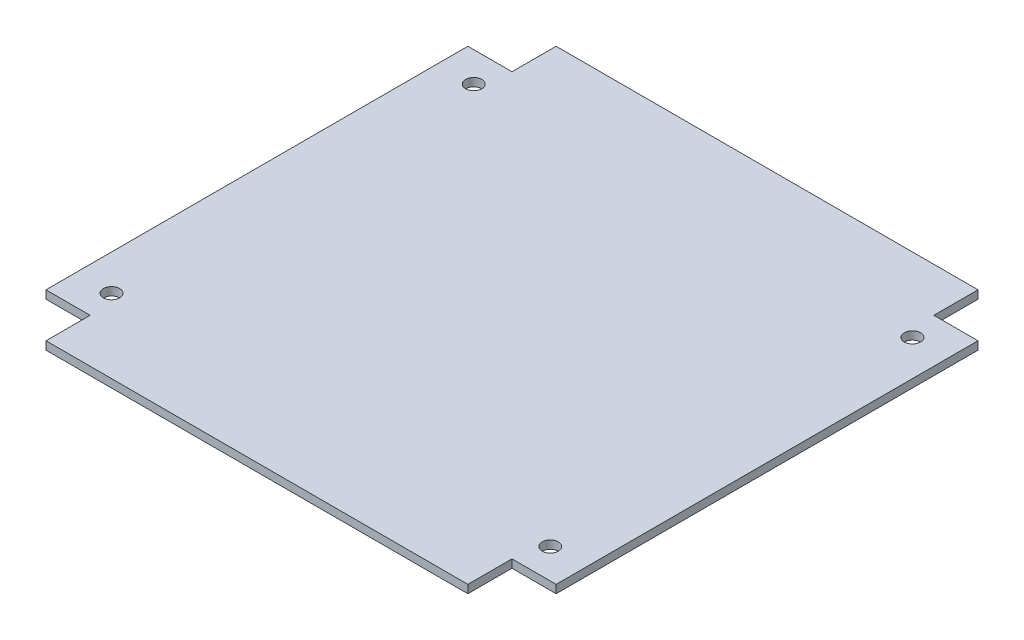
ISO-10303-21;
HEADER;
FILE_DESCRIPTION(('STEP AP214'),'2;1');
FILE_NAME('part.step','',(''),(''),'','','');
FILE_SCHEMA(('AUTOMOTIVE_DESIGN { 1 0 10303 214 1 1 1 1 }'));
ENDSEC;
DATA;
#1=APPLICATION_CONTEXT('core data for automotive mechanical design processes');
#2=APPLICATION_PROTOCOL_DEFINITION('international standard','automotive_design',2000,#1);
#3=PRODUCT_CONTEXT('',#1,'mechanical');
#4=PRODUCT('Part','Part','',(#3));
#5=PRODUCT_RELATED_PRODUCT_CATEGORY('part','',(#4));
#6=PRODUCT_DEFINITION_FORMATION('','',#4);
#7=PRODUCT_DEFINITION_CONTEXT('part definition',#1,'design');
#8=PRODUCT_DEFINITION('design','',#6,#7);
#9=PRODUCT_DEFINITION_SHAPE('','',#8);
#10=(LENGTH_UNIT() NAMED_UNIT(*) SI_UNIT(.MILLI.,.METRE.));
#11=(NAMED_UNIT(*) PLANE_ANGLE_UNIT() SI_UNIT($,.RADIAN.));
#12=(NAMED_UNIT(*) SI_UNIT($,.STERADIAN.) SOLID_ANGLE_UNIT());
#13=UNCERTAINTY_MEASURE_WITH_UNIT(LENGTH_MEASURE(1.E-05),#10,'distance_accuracy_value','');
#14=(GEOMETRIC_REPRESENTATION_CONTEXT(3) GLOBAL_UNCERTAINTY_ASSIGNED_CONTEXT((#13)) GLOBAL_UNIT_ASSIGNED_CONTEXT((#10,
#11,#12)) REPRESENTATION_CONTEXT('',''));
#15=CARTESIAN_POINT('',(0.,0.,0.));
#16=DIRECTION('',(0.,0.,1.));
#17=DIRECTION('',(1.,0.,0.));
#18=AXIS2_PLACEMENT_3D('',#15,#16,#17);
#19=CARTESIAN_POINT('',(41.350000000024,6.5,0.));
#20=DIRECTION('',(-1.,0.,0.));
#21=DIRECTION('',(0.,0.,1.));
#22=AXIS2_PLACEMENT_3D('',#19,#20,#21);
#23=PLANE('',#22);
#24=DIRECTION('',(0.,0.,1.));
#25=VECTOR('',#24,1.);
#26=CARTESIAN_POINT('',(41.350000000024,8.1,0.));
#27=LINE('',#26,#25);
#28=CARTESIAN_POINT('',(41.350000000024,8.09999999999998,41.35));
#29=VERTEX_POINT('',#28);
#30=CARTESIAN_POINT('',(41.350000000024,8.09999999999998,50.));
#31=VERTEX_POINT('',#30);
#32=EDGE_CURVE('E155',#29,#31,#27,.T.);
#33=ORIENTED_EDGE('',*,*,#32,.T.);
#34=DIRECTION('',(0.,1.,0.));
#35=VECTOR('',#34,1.);
#36=CARTESIAN_POINT('',(41.350000000024,6.49999999999998,50.));
#37=LINE('',#36,#35);
#38=CARTESIAN_POINT('',(41.350000000024,6.49999999999998,50.));
#39=VERTEX_POINT('',#38);
#40=EDGE_CURVE('E11',#39,#31,#37,.T.);
#41=ORIENTED_EDGE('',*,*,#40,.F.);
#42=DIRECTION('',(0.,0.,1.));
#43=VECTOR('',#42,1.);
#44=CARTESIAN_POINT('',(41.350000000024,6.5,0.));
#45=LINE('',#44,#43);
#46=CARTESIAN_POINT('',(41.350000000024,6.49999999999998,41.35));
#47=VERTEX_POINT('',#46);
#48=EDGE_CURVE('E178',#47,#39,#45,.T.);
#49=ORIENTED_EDGE('',*,*,#48,.F.);
#50=DIRECTION('',(0.,1.,0.));
#51=VECTOR('',#50,1.);
#52=CARTESIAN_POINT('',(41.350000000024,6.49999999999998,41.35));
#53=LINE('',#52,#51);
#54=EDGE_CURVE('E151',#47,#29,#53,.T.);
#55=ORIENTED_EDGE('',*,*,#54,.T.);
#56=EDGE_LOOP('',(#33,#41,#49,#55));
#57=FACE_BOUND('',#56,.T.);
#58=ADVANCED_FACE('F35',(#57),#23,.F.);
#59=CARTESIAN_POINT('',(-31.3931966356491,6.49999999999998,50.));
#60=DIRECTION('',(0.,0.,-1.));
#61=DIRECTION('',(-1.,0.,0.));
#62=AXIS2_PLACEMENT_3D('',#59,#60,#61);
#63=PLANE('',#62);
#64=DIRECTION('',(-1.,0.,0.));
#65=VECTOR('',#64,1.);
#66=CARTESIAN_POINT('',(-31.3931966356491,8.09999999999998,50.));
#67=LINE('',#66,#65);
#68=CARTESIAN_POINT('',(-41.350000000024,8.09999999999998,50.));
#69=VERTEX_POINT('',#68);
#70=EDGE_CURVE('E158',#31,#69,#67,.T.);
#71=ORIENTED_EDGE('',*,*,#70,.T.);
#72=DIRECTION('',(0.,1.,0.));
#73=VECTOR('',#72,1.);
#74=CARTESIAN_POINT('',(-41.350000000024,6.49999999999998,50.));
#75=LINE('',#74,#73);
#76=CARTESIAN_POINT('',(-41.350000000024,6.49999999999998,50.));
#77=VERTEX_POINT('',#76);
#78=EDGE_CURVE('E43',#77,#69,#75,.T.);
#79=ORIENTED_EDGE('',*,*,#78,.F.);
#80=DIRECTION('',(-1.,0.,0.));
#81=VECTOR('',#80,1.);
#82=CARTESIAN_POINT('',(-31.3931966356491,6.49999999999998,50.));
#83=LINE('',#82,#81);
#84=EDGE_CURVE('E106',#39,#77,#83,.T.);
#85=ORIENTED_EDGE('',*,*,#84,.F.);
#86=ORIENTED_EDGE('',*,*,#40,.T.);
#87=EDGE_LOOP('',(#71,#79,#85,#86));
#88=FACE_BOUND('',#87,.T.);
#89=ADVANCED_FACE('F257',(#88),#63,.F.);
#90=CARTESIAN_POINT('',(-41.350000000024,6.5,0.));
#91=DIRECTION('',(1.,0.,0.));
#92=DIRECTION('',(0.,0.,-1.));
#93=AXIS2_PLACEMENT_3D('',#90,#91,#92);
#94=PLANE('',#93);
#95=DIRECTION('',(0.,0.,-1.));
#96=VECTOR('',#95,1.);
#97=CARTESIAN_POINT('',(-41.350000000024,8.1,0.));
#98=LINE('',#97,#96);
#99=CARTESIAN_POINT('',(-41.350000000024,8.09999999999998,41.35));
#100=VERTEX_POINT('',#99);
#101=EDGE_CURVE('E161',#69,#100,#98,.T.);
#102=ORIENTED_EDGE('',*,*,#101,.T.);
#103=DIRECTION('',(0.,1.,0.));
#104=VECTOR('',#103,1.);
#105=CARTESIAN_POINT('',(-41.350000000024,6.49999999999998,41.35));
#106=LINE('',#105,#104);
#107=CARTESIAN_POINT('',(-41.350000000024,6.49999999999998,41.35));
#108=VERTEX_POINT('',#107);
#109=EDGE_CURVE('E197',#108,#100,#106,.T.);
#110=ORIENTED_EDGE('',*,*,#109,.F.);
#111=DIRECTION('',(0.,0.,-1.));
#112=VECTOR('',#111,1.);
#113=CARTESIAN_POINT('',(-41.350000000024,6.5,0.));
#114=LINE('',#113,#112);
#115=EDGE_CURVE('E205',#77,#108,#114,.T.);
#116=ORIENTED_EDGE('',*,*,#115,.F.);
#117=ORIENTED_EDGE('',*,*,#78,.T.);
#118=EDGE_LOOP('',(#102,#110,#116,#117));
#119=FACE_BOUND('',#118,.T.);
#120=ADVANCED_FACE('F203',(#119),#94,.F.);
#121=CARTESIAN_POINT('',(-31.3931966356491,6.49999999999998,41.35));
#122=DIRECTION('',(0.,0.,-1.));
#123=DIRECTION('',(-1.,0.,0.));
#124=AXIS2_PLACEMENT_3D('',#121,#122,#123);
#125=PLANE('',#124);
#126=DIRECTION('',(-1.,0.,0.));
#127=VECTOR('',#126,1.);
#128=CARTESIAN_POINT('',(-31.3931966356491,8.09999999999998,41.35));
#129=LINE('',#128,#127);
#130=CARTESIAN_POINT('',(-50.000000000024,8.09999999999998,41.35));
#131=VERTEX_POINT('',#130);
#132=EDGE_CURVE('E163',#100,#131,#129,.T.);
#133=ORIENTED_EDGE('',*,*,#132,.T.);
#134=DIRECTION('',(0.,1.,0.));
#135=VECTOR('',#134,1.);
#136=CARTESIAN_POINT('',(-50.000000000024,6.49999999999998,41.35));
#137=LINE('',#136,#135);
#138=CARTESIAN_POINT('',(-50.000000000024,6.49999999999998,41.35));
#139=VERTEX_POINT('',#138);
#140=EDGE_CURVE('E194',#139,#131,#137,.T.);
#141=ORIENTED_EDGE('',*,*,#140,.F.);
#142=DIRECTION('',(-1.,0.,0.));
#143=VECTOR('',#142,1.);
#144=CARTESIAN_POINT('',(-31.3931966356491,6.49999999999998,41.35));
#145=LINE('',#144,#143);
#146=EDGE_CURVE('E223',#108,#139,#145,.T.);
#147=ORIENTED_EDGE('',*,*,#146,.F.);
#148=ORIENTED_EDGE('',*,*,#109,.T.);
#149=EDGE_LOOP('',(#133,#141,#147,#148));
#150=FACE_BOUND('',#149,.T.);
#151=ADVANCED_FACE('F214',(#150),#125,.F.);
#152=CARTESIAN_POINT('',(-50.000000000024,6.5,0.));
#153=DIRECTION('',(1.,0.,0.));
#154=DIRECTION('',(0.,0.,-1.));
#155=AXIS2_PLACEMENT_3D('',#152,#153,#154);
#156=PLANE('',#155);
#157=DIRECTION('',(0.,0.,-1.));
#158=VECTOR('',#157,1.);
#159=CARTESIAN_POINT('',(-50.000000000024,8.1,0.));
#160=LINE('',#159,#158);
#161=CARTESIAN_POINT('',(-50.000000000024,8.10000000000001,-41.35));
#162=VERTEX_POINT('',#161);
#163=EDGE_CURVE('E165',#131,#162,#160,.T.);
#164=ORIENTED_EDGE('',*,*,#163,.T.);
#165=DIRECTION('',(0.,1.,0.));
#166=VECTOR('',#165,1.);
#167=CARTESIAN_POINT('',(-50.000000000024,6.50000000000001,-41.35));
#168=LINE('',#167,#166);
#169=CARTESIAN_POINT('',(-50.000000000024,6.50000000000001,-41.35));
#170=VERTEX_POINT('',#169);
#171=EDGE_CURVE('E191',#170,#162,#168,.T.);
#172=ORIENTED_EDGE('',*,*,#171,.F.);
#173=DIRECTION('',(0.,0.,-1.));
#174=VECTOR('',#173,1.);
#175=CARTESIAN_POINT('',(-50.000000000024,6.5,0.));
#176=LINE('',#175,#174);
#177=EDGE_CURVE('E220',#139,#170,#176,.T.);
#178=ORIENTED_EDGE('',*,*,#177,.F.);
#179=ORIENTED_EDGE('',*,*,#140,.T.);
#180=EDGE_LOOP('',(#164,#172,#178,#179));
#181=FACE_BOUND('',#180,.T.);
#182=ADVANCED_FACE('F218',(#181),#156,.F.);
#183=CARTESIAN_POINT('',(-31.3931966356492,6.50000000000001,-41.35));
#184=DIRECTION('',(0.,0.,1.));
#185=DIRECTION('',(1.,0.,0.));
#186=AXIS2_PLACEMENT_3D('',#183,#184,#185);
#187=PLANE('',#186);
#188=DIRECTION('',(1.,0.,0.));
#189=VECTOR('',#188,1.);
#190=CARTESIAN_POINT('',(-31.3931966356492,8.10000000000001,-41.35));
#191=LINE('',#190,#189);
#192=CARTESIAN_POINT('',(-41.350000000024,8.10000000000001,-41.35));
#193=VERTEX_POINT('',#192);
#194=EDGE_CURVE('E167',#162,#193,#191,.T.);
#195=ORIENTED_EDGE('',*,*,#194,.T.);
#196=DIRECTION('',(0.,1.,0.));
#197=VECTOR('',#196,1.);
#198=CARTESIAN_POINT('',(-41.350000000024,6.50000000000001,-41.35));
#199=LINE('',#198,#197);
#200=CARTESIAN_POINT('',(-41.350000000024,6.50000000000001,-41.35));
#201=VERTEX_POINT('',#200);
#202=EDGE_CURVE('E188',#201,#193,#199,.T.);
#203=ORIENTED_EDGE('',*,*,#202,.F.);
#204=DIRECTION('',(1.,0.,0.));
#205=VECTOR('',#204,1.);
#206=CARTESIAN_POINT('',(-31.3931966356492,6.50000000000001,-41.35));
#207=LINE('',#206,#205);
#208=EDGE_CURVE('E222',#170,#201,#207,.T.);
#209=ORIENTED_EDGE('',*,*,#208,.F.);
#210=ORIENTED_EDGE('',*,*,#171,.T.);
#211=EDGE_LOOP('',(#195,#203,#209,#210));
#212=FACE_BOUND('',#211,.T.);
#213=ADVANCED_FACE('F270',(#212),#187,.F.);
#214=CARTESIAN_POINT('',(-41.350000000024,6.5,0.));
#215=DIRECTION('',(1.,0.,0.));
#216=DIRECTION('',(0.,0.,-1.));
#217=AXIS2_PLACEMENT_3D('',#214,#215,#216);
#218=PLANE('',#217);
#219=DIRECTION('',(0.,0.,-1.));
#220=VECTOR('',#219,1.);
#221=CARTESIAN_POINT('',(-41.350000000024,8.1,0.));
#222=LINE('',#221,#220);
#223=CARTESIAN_POINT('',(-41.350000000024,8.10000000000001,-50.));
#224=VERTEX_POINT('',#223);
#225=EDGE_CURVE('E169',#193,#224,#222,.T.);
#226=ORIENTED_EDGE('',*,*,#225,.T.);
#227=DIRECTION('',(0.,1.,0.));
#228=VECTOR('',#227,1.);
#229=CARTESIAN_POINT('',(-41.350000000024,6.50000000000001,-50.));
#230=LINE('',#229,#228);
#231=CARTESIAN_POINT('',(-41.350000000024,6.50000000000001,-50.));
#232=VERTEX_POINT('',#231);
#233=EDGE_CURVE('E185',#232,#224,#230,.T.);
#234=ORIENTED_EDGE('',*,*,#233,.F.);
#235=DIRECTION('',(0.,0.,-1.));
#236=VECTOR('',#235,1.);
#237=CARTESIAN_POINT('',(-41.350000000024,6.5,0.));
#238=LINE('',#237,#236);
#239=EDGE_CURVE('E225',#201,#232,#238,.T.);
#240=ORIENTED_EDGE('',*,*,#239,.F.);
#241=ORIENTED_EDGE('',*,*,#202,.T.);
#242=EDGE_LOOP('',(#226,#234,#240,#241));
#243=FACE_BOUND('',#242,.T.);
#244=ADVANCED_FACE('F273',(#243),#218,.F.);
#245=CARTESIAN_POINT('',(-31.3931966356491,6.50000000000001,-50.));
#246=DIRECTION('',(0.,0.,1.));
#247=DIRECTION('',(1.,0.,0.));
#248=AXIS2_PLACEMENT_3D('',#245,#246,#247);
#249=PLANE('',#248);
#250=DIRECTION('',(1.,0.,0.));
#251=VECTOR('',#250,1.);
#252=CARTESIAN_POINT('',(-31.3931966356491,8.10000000000001,-50.));
#253=LINE('',#252,#251);
#254=CARTESIAN_POINT('',(41.350000000024,8.10000000000001,-50.));
#255=VERTEX_POINT('',#254);
#256=EDGE_CURVE('E171',#224,#255,#253,.T.);
#257=ORIENTED_EDGE('',*,*,#256,.T.);
#258=DIRECTION('',(0.,1.,0.));
#259=VECTOR('',#258,1.);
#260=CARTESIAN_POINT('',(41.350000000024,6.50000000000001,-50.));
#261=LINE('',#260,#259);
#262=CARTESIAN_POINT('',(41.350000000024,6.50000000000001,-50.));
#263=VERTEX_POINT('',#262);
#264=EDGE_CURVE('E182',#263,#255,#261,.T.);
#265=ORIENTED_EDGE('',*,*,#264,.F.);
#266=DIRECTION('',(1.,0.,0.));
#267=VECTOR('',#266,1.);
#268=CARTESIAN_POINT('',(-31.3931966356491,6.50000000000001,-50.));
#269=LINE('',#268,#267);
#270=EDGE_CURVE('E231',#232,#263,#269,.T.);
#271=ORIENTED_EDGE('',*,*,#270,.F.);
#272=ORIENTED_EDGE('',*,*,#233,.T.);
#273=EDGE_LOOP('',(#257,#265,#271,#272));
#274=FACE_BOUND('',#273,.T.);
#275=ADVANCED_FACE('F237',(#274),#249,.F.);
#276=CARTESIAN_POINT('',(41.350000000024,6.5,-1.41452619708617E-13));
#277=DIRECTION('',(-1.,0.,0.));
#278=DIRECTION('',(0.,0.,1.));
#279=AXIS2_PLACEMENT_3D('',#276,#277,#278);
#280=PLANE('',#279);
#281=DIRECTION('',(0.,0.,1.));
#282=VECTOR('',#281,1.);
#283=CARTESIAN_POINT('',(41.350000000024,8.1,-1.41452619708617E-13));
#284=LINE('',#283,#282);
#285=CARTESIAN_POINT('',(41.350000000024,8.10000000000001,-41.35));
#286=VERTEX_POINT('',#285);
#287=EDGE_CURVE('E173',#255,#286,#284,.T.);
#288=ORIENTED_EDGE('',*,*,#287,.T.);
#289=DIRECTION('',(0.,1.,0.));
#290=VECTOR('',#289,1.);
#291=CARTESIAN_POINT('',(41.350000000024,6.50000000000001,-41.35));
#292=LINE('',#291,#290);
#293=CARTESIAN_POINT('',(41.350000000024,6.50000000000001,-41.35));
#294=VERTEX_POINT('',#293);
#295=EDGE_CURVE('E146',#294,#286,#292,.T.);
#296=ORIENTED_EDGE('',*,*,#295,.F.);
#297=DIRECTION('',(0.,0.,1.));
#298=VECTOR('',#297,1.);
#299=CARTESIAN_POINT('',(41.350000000024,6.5,-1.41452619708617E-13));
#300=LINE('',#299,#298);
#301=EDGE_CURVE('E137',#263,#294,#300,.T.);
#302=ORIENTED_EDGE('',*,*,#301,.F.);
#303=ORIENTED_EDGE('',*,*,#264,.T.);
#304=EDGE_LOOP('',(#288,#296,#302,#303));
#305=FACE_BOUND('',#304,.T.);
#306=ADVANCED_FACE('F241',(#305),#280,.F.);
#307=CARTESIAN_POINT('',(-31.3931966356491,6.50000000000001,-41.3500000000001));
#308=DIRECTION('',(0.,0.,1.));
#309=DIRECTION('',(1.,0.,0.));
#310=AXIS2_PLACEMENT_3D('',#307,#308,#309);
#311=PLANE('',#310);
#312=DIRECTION('',(1.,0.,0.));
#313=VECTOR('',#312,1.);
#314=CARTESIAN_POINT('',(-31.3931966356491,8.10000000000001,-41.3500000000001));
#315=LINE('',#314,#313);
#316=CARTESIAN_POINT('',(50.000000000024,8.10000000000001,-41.35));
#317=VERTEX_POINT('',#316);
#318=EDGE_CURVE('E145',#286,#317,#315,.T.);
#319=ORIENTED_EDGE('',*,*,#318,.T.);
#320=DIRECTION('',(0.,1.,0.));
#321=VECTOR('',#320,1.);
#322=CARTESIAN_POINT('',(50.000000000024,6.50000000000001,-41.35));
#323=LINE('',#322,#321);
#324=CARTESIAN_POINT('',(50.000000000024,6.50000000000001,-41.35));
#325=VERTEX_POINT('',#324);
#326=EDGE_CURVE('E142',#325,#317,#323,.T.);
#327=ORIENTED_EDGE('',*,*,#326,.F.);
#328=DIRECTION('',(1.,0.,0.));
#329=VECTOR('',#328,1.);
#330=CARTESIAN_POINT('',(-31.3931966356491,6.50000000000001,-41.3500000000001));
#331=LINE('',#330,#329);
#332=EDGE_CURVE('E131',#294,#325,#331,.T.);
#333=ORIENTED_EDGE('',*,*,#332,.F.);
#334=ORIENTED_EDGE('',*,*,#295,.T.);
#335=EDGE_LOOP('',(#319,#327,#333,#334));
#336=FACE_BOUND('',#335,.T.);
#337=ADVANCED_FACE('F143',(#336),#311,.F.);
#338=CARTESIAN_POINT('',(50.000000000024,6.5,0.));
#339=DIRECTION('',(-1.,0.,0.));
#340=DIRECTION('',(0.,0.,1.));
#341=AXIS2_PLACEMENT_3D('',#338,#339,#340);
#342=PLANE('',#341);
#343=DIRECTION('',(0.,0.,1.));
#344=VECTOR('',#343,1.);
#345=CARTESIAN_POINT('',(50.000000000024,8.1,0.));
#346=LINE('',#345,#344);
#347=CARTESIAN_POINT('',(50.000000000024,8.09999999999998,41.35));
#348=VERTEX_POINT('',#347);
#349=EDGE_CURVE('E92',#317,#348,#346,.T.);
#350=ORIENTED_EDGE('',*,*,#349,.T.);
#351=DIRECTION('',(0.,1.,0.));
#352=VECTOR('',#351,1.);
#353=CARTESIAN_POINT('',(50.000000000024,6.49999999999998,41.35));
#354=LINE('',#353,#352);
#355=CARTESIAN_POINT('',(50.000000000024,6.49999999999998,41.35));
#356=VERTEX_POINT('',#355);
#357=EDGE_CURVE('E147',#356,#348,#354,.T.);
#358=ORIENTED_EDGE('',*,*,#357,.F.);
#359=DIRECTION('',(0.,0.,1.));
#360=VECTOR('',#359,1.);
#361=CARTESIAN_POINT('',(50.000000000024,6.5,0.));
#362=LINE('',#361,#360);
#363=EDGE_CURVE('E135',#325,#356,#362,.T.);
#364=ORIENTED_EDGE('',*,*,#363,.F.);
#365=ORIENTED_EDGE('',*,*,#326,.T.);
#366=EDGE_LOOP('',(#350,#358,#364,#365));
#367=FACE_BOUND('',#366,.T.);
#368=ADVANCED_FACE('F149',(#367),#342,.F.);
#369=CARTESIAN_POINT('',(-31.3931966356491,6.49999999999998,41.3500000000001));
#370=DIRECTION('',(0.,0.,-1.));
#371=DIRECTION('',(-1.,0.,0.));
#372=AXIS2_PLACEMENT_3D('',#369,#370,#371);
#373=PLANE('',#372);
#374=DIRECTION('',(-1.,0.,0.));
#375=VECTOR('',#374,1.);
#376=CARTESIAN_POINT('',(-31.3931966356491,8.09999999999998,41.3500000000001));
#377=LINE('',#376,#375);
#378=EDGE_CURVE('E98',#348,#29,#377,.T.);
#379=ORIENTED_EDGE('',*,*,#378,.T.);
#380=ORIENTED_EDGE('',*,*,#54,.F.);
#381=DIRECTION('',(-1.,0.,0.));
#382=VECTOR('',#381,1.);
#383=CARTESIAN_POINT('',(-31.3931966356491,6.49999999999998,41.3500000000001));
#384=LINE('',#383,#382);
#385=EDGE_CURVE('E51',#356,#47,#384,.T.);
#386=ORIENTED_EDGE('',*,*,#385,.F.);
#387=ORIENTED_EDGE('',*,*,#357,.T.);
#388=EDGE_LOOP('',(#379,#380,#386,#387));
#389=FACE_BOUND('',#388,.T.);
#390=ADVANCED_FACE('F245',(#389),#373,.F.);
#391=CARTESIAN_POINT('',(0.,6.5,0.));
#392=DIRECTION('',(0.,-1.,0.));
#393=DIRECTION('',(0.,0.,-1.));
#394=AXIS2_PLACEMENT_3D('',#391,#392,#393);
#395=PLANE('',#394);
#396=CARTESIAN_POINT('',(-43.000000000024,6.49999999999998,35.5));
#397=DIRECTION('',(0.,1.,0.));
#398=DIRECTION('',(0.,0.,1.));
#399=AXIS2_PLACEMENT_3D('',#396,#397,#398);
#400=CIRCLE('',#399,1.59);
#401=CARTESIAN_POINT('',(-43.000000000024,6.49999999999998,37.09));
#402=VERTEX_POINT('',#401);
#403=EDGE_CURVE('E358',#402,#402,#400,.T.);
#404=ORIENTED_EDGE('',*,*,#403,.T.);
#405=EDGE_LOOP('',(#404));
#406=FACE_BOUND('',#405,.T.);
#407=CARTESIAN_POINT('',(43.000000000024,6.49999999999998,35.5));
#408=DIRECTION('',(0.,1.,0.));
#409=DIRECTION('',(0.,0.,1.));
#410=AXIS2_PLACEMENT_3D('',#407,#408,#409);
#411=CIRCLE('',#410,1.59000000000002);
#412=CARTESIAN_POINT('',(43.000000000024,6.49999999999998,37.09));
#413=VERTEX_POINT('',#412);
#414=EDGE_CURVE('E366',#413,#413,#411,.T.);
#415=ORIENTED_EDGE('',*,*,#414,.T.);
#416=EDGE_LOOP('',(#415));
#417=FACE_BOUND('',#416,.T.);
#418=CARTESIAN_POINT('',(43.000000000024,6.50000000000001,-35.5));
#419=DIRECTION('',(0.,1.,0.));
#420=DIRECTION('',(0.,0.,1.));
#421=AXIS2_PLACEMENT_3D('',#418,#419,#420);
#422=CIRCLE('',#421,1.59000000000002);
#423=CARTESIAN_POINT('',(43.000000000024,6.50000000000001,-33.91));
#424=VERTEX_POINT('',#423);
#425=EDGE_CURVE('E372',#424,#424,#422,.T.);
#426=ORIENTED_EDGE('',*,*,#425,.T.);
#427=EDGE_LOOP('',(#426));
#428=FACE_BOUND('',#427,.T.);
#429=CARTESIAN_POINT('',(-43.000000000024,6.50000000000001,-35.5));
#430=DIRECTION('',(0.,1.,0.));
#431=DIRECTION('',(0.,0.,1.));
#432=AXIS2_PLACEMENT_3D('',#429,#430,#431);
#433=CIRCLE('',#432,1.59);
#434=CARTESIAN_POINT('',(-43.000000000024,6.50000000000001,-33.91));
#435=VERTEX_POINT('',#434);
#436=EDGE_CURVE('E159',#435,#435,#433,.T.);
#437=ORIENTED_EDGE('',*,*,#436,.T.);
#438=EDGE_LOOP('',(#437));
#439=FACE_BOUND('',#438,.T.);
#440=ORIENTED_EDGE('',*,*,#48,.T.);
#441=ORIENTED_EDGE('',*,*,#84,.T.);
#442=ORIENTED_EDGE('',*,*,#115,.T.);
#443=ORIENTED_EDGE('',*,*,#146,.T.);
#444=ORIENTED_EDGE('',*,*,#177,.T.);
#445=ORIENTED_EDGE('',*,*,#208,.T.);
#446=ORIENTED_EDGE('',*,*,#239,.T.);
#447=ORIENTED_EDGE('',*,*,#270,.T.);
#448=ORIENTED_EDGE('',*,*,#301,.T.);
#449=ORIENTED_EDGE('',*,*,#332,.T.);
#450=ORIENTED_EDGE('',*,*,#363,.T.);
#451=ORIENTED_EDGE('',*,*,#385,.T.);
#452=EDGE_LOOP('',(#440,#441,#442,#443,#444,#445,#446,#447,#448,#449,#450,#451));
#453=FACE_BOUND('',#452,.T.);
#454=ADVANCED_FACE('F133',(#406,#417,#428,#439,#453),#395,.T.);
#455=CARTESIAN_POINT('',(0.,8.1,0.));
#456=DIRECTION('',(0.,-1.,0.));
#457=DIRECTION('',(0.,0.,-1.));
#458=AXIS2_PLACEMENT_3D('',#455,#456,#457);
#459=PLANE('',#458);
#460=CARTESIAN_POINT('',(-43.000000000024,8.09999999999998,35.5));
#461=DIRECTION('',(0.,1.,0.));
#462=DIRECTION('',(0.,0.,1.));
#463=AXIS2_PLACEMENT_3D('',#460,#461,#462);
#464=CIRCLE('',#463,1.59);
#465=CARTESIAN_POINT('',(-43.000000000024,8.09999999999998,37.09));
#466=VERTEX_POINT('',#465);
#467=EDGE_CURVE('E361',#466,#466,#464,.T.);
#468=ORIENTED_EDGE('',*,*,#467,.F.);
#469=EDGE_LOOP('',(#468));
#470=FACE_BOUND('',#469,.T.);
#471=CARTESIAN_POINT('',(43.000000000024,8.09999999999998,35.5));
#472=DIRECTION('',(0.,1.,0.));
#473=DIRECTION('',(0.,0.,1.));
#474=AXIS2_PLACEMENT_3D('',#471,#472,#473);
#475=CIRCLE('',#474,1.59000000000002);
#476=CARTESIAN_POINT('',(43.000000000024,8.09999999999998,37.09));
#477=VERTEX_POINT('',#476);
#478=EDGE_CURVE('E363',#477,#477,#475,.T.);
#479=ORIENTED_EDGE('',*,*,#478,.F.);
#480=EDGE_LOOP('',(#479));
#481=FACE_BOUND('',#480,.T.);
#482=CARTESIAN_POINT('',(43.000000000024,8.10000000000001,-35.5));
#483=DIRECTION('',(0.,1.,0.));
#484=DIRECTION('',(0.,0.,1.));
#485=AXIS2_PLACEMENT_3D('',#482,#483,#484);
#486=CIRCLE('',#485,1.59000000000002);
#487=CARTESIAN_POINT('',(43.000000000024,8.10000000000001,-33.91));
#488=VERTEX_POINT('',#487);
#489=EDGE_CURVE('E369',#488,#488,#486,.T.);
#490=ORIENTED_EDGE('',*,*,#489,.F.);
#491=EDGE_LOOP('',(#490));
#492=FACE_BOUND('',#491,.T.);
#493=CARTESIAN_POINT('',(-43.000000000024,8.10000000000001,-35.5));
#494=DIRECTION('',(0.,1.,0.));
#495=DIRECTION('',(0.,0.,1.));
#496=AXIS2_PLACEMENT_3D('',#493,#494,#495);
#497=CIRCLE('',#496,1.59);
#498=CARTESIAN_POINT('',(-43.000000000024,8.10000000000001,-33.91));
#499=VERTEX_POINT('',#498);
#500=EDGE_CURVE('E375',#499,#499,#497,.T.);
#501=ORIENTED_EDGE('',*,*,#500,.F.);
#502=EDGE_LOOP('',(#501));
#503=FACE_BOUND('',#502,.T.);
#504=ORIENTED_EDGE('',*,*,#32,.F.);
#505=ORIENTED_EDGE('',*,*,#378,.F.);
#506=ORIENTED_EDGE('',*,*,#349,.F.);
#507=ORIENTED_EDGE('',*,*,#318,.F.);
#508=ORIENTED_EDGE('',*,*,#287,.F.);
#509=ORIENTED_EDGE('',*,*,#256,.F.);
#510=ORIENTED_EDGE('',*,*,#225,.F.);
#511=ORIENTED_EDGE('',*,*,#194,.F.);
#512=ORIENTED_EDGE('',*,*,#163,.F.);
#513=ORIENTED_EDGE('',*,*,#132,.F.);
#514=ORIENTED_EDGE('',*,*,#101,.F.);
#515=ORIENTED_EDGE('',*,*,#70,.F.);
#516=EDGE_LOOP('',(#504,#505,#506,#507,#508,#509,#510,#511,#512,#513,#514,#515));
#517=FACE_BOUND('',#516,.T.);
#518=ADVANCED_FACE('F209',(#470,#481,#492,#503,#517),#459,.F.);
#519=CARTESIAN_POINT('',(-43.000000000024,6.50000000000001,-35.5));
#520=DIRECTION('',(0.,1.,0.));
#521=DIRECTION('',(0.,0.,1.));
#522=AXIS2_PLACEMENT_3D('',#519,#520,#521);
#523=CYLINDRICAL_SURFACE('',#522,1.59);
#524=ORIENTED_EDGE('',*,*,#436,.F.);
#525=EDGE_LOOP('',(#524));
#526=FACE_BOUND('',#525,.T.);
#527=ORIENTED_EDGE('',*,*,#500,.T.);
#528=EDGE_LOOP('',(#527));
#529=FACE_BOUND('',#528,.T.);
#530=ADVANCED_FACE('F313',(#526,#529),#523,.F.);
#531=CARTESIAN_POINT('',(43.000000000024,6.50000000000001,-35.5));
#532=DIRECTION('',(0.,1.,0.));
#533=DIRECTION('',(0.,0.,1.));
#534=AXIS2_PLACEMENT_3D('',#531,#532,#533);
#535=CYLINDRICAL_SURFACE('',#534,1.59000000000002);
#536=ORIENTED_EDGE('',*,*,#425,.F.);
#537=EDGE_LOOP('',(#536));
#538=FACE_BOUND('',#537,.T.);
#539=ORIENTED_EDGE('',*,*,#489,.T.);
#540=EDGE_LOOP('',(#539));
#541=FACE_BOUND('',#540,.T.);
#542=ADVANCED_FACE('F322',(#538,#541),#535,.F.);
#543=CARTESIAN_POINT('',(43.000000000024,6.49999999999998,35.5));
#544=DIRECTION('',(0.,1.,0.));
#545=DIRECTION('',(0.,0.,1.));
#546=AXIS2_PLACEMENT_3D('',#543,#544,#545);
#547=CYLINDRICAL_SURFACE('',#546,1.59000000000002);
#548=ORIENTED_EDGE('',*,*,#414,.F.);
#549=EDGE_LOOP('',(#548));
#550=FACE_BOUND('',#549,.T.);
#551=ORIENTED_EDGE('',*,*,#478,.T.);
#552=EDGE_LOOP('',(#551));
#553=FACE_BOUND('',#552,.T.);
#554=ADVANCED_FACE('F332',(#550,#553),#547,.F.);
#555=CARTESIAN_POINT('',(-43.000000000024,6.49999999999998,35.5));
#556=DIRECTION('',(0.,1.,0.));
#557=DIRECTION('',(0.,0.,1.));
#558=AXIS2_PLACEMENT_3D('',#555,#556,#557);
#559=CYLINDRICAL_SURFACE('',#558,1.59);
#560=ORIENTED_EDGE('',*,*,#403,.F.);
#561=EDGE_LOOP('',(#560));
#562=FACE_BOUND('',#561,.T.);
#563=ORIENTED_EDGE('',*,*,#467,.T.);
#564=EDGE_LOOP('',(#563));
#565=FACE_BOUND('',#564,.T.);
#566=ADVANCED_FACE('F342',(#562,#565),#559,.F.);
#567=CLOSED_SHELL('',(#58,#89,#120,#151,#182,#213,#244,#275,#306,#337,#368,#390,#454,#518,#530,
#542,#554,#566));
#568=MANIFOLD_SOLID_BREP('B2',#567);
#569=ADVANCED_BREP_SHAPE_REPRESENTATION('',(#18,#568),#14);
#570=SHAPE_DEFINITION_REPRESENTATION(#9,#569);
ENDSEC;
END-ISO-10303-21;
